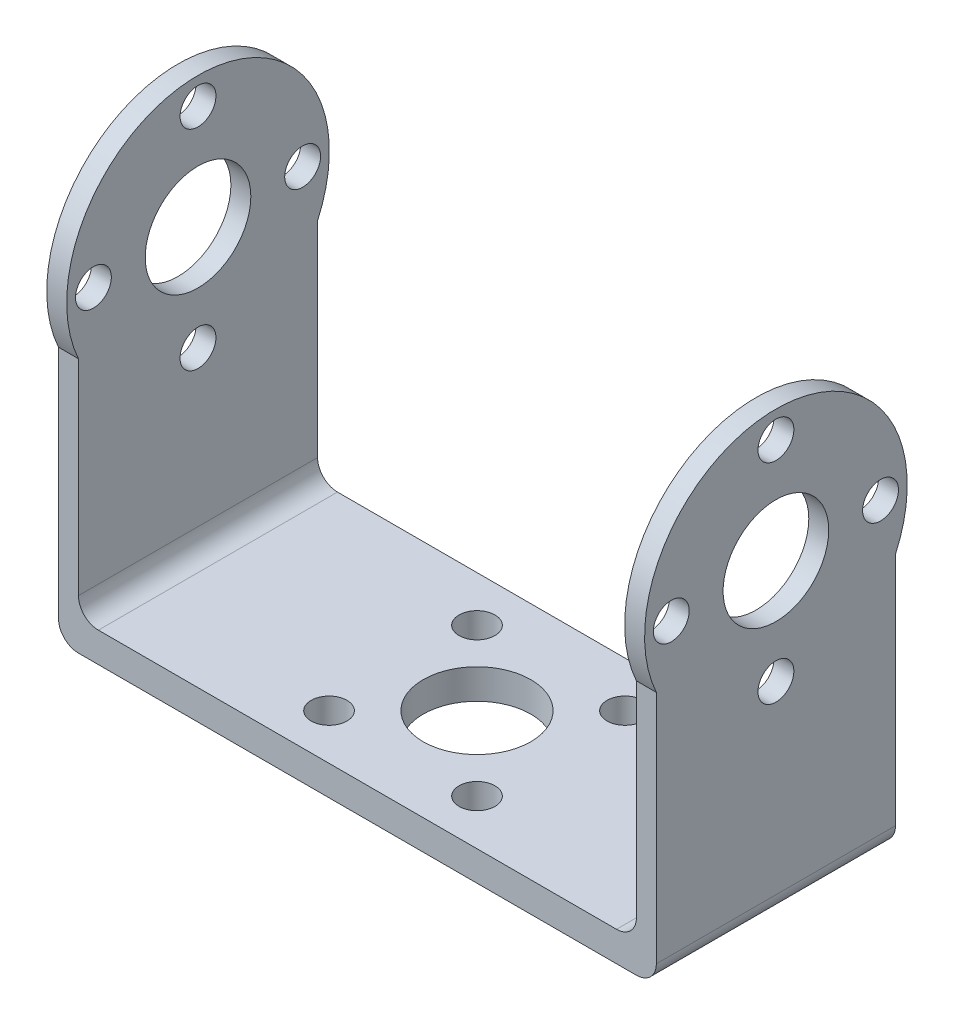
ISO-10303-21;
HEADER;
FILE_DESCRIPTION(('STEP AP214'),'2;1');
FILE_NAME('part.step','',(''),(''),'','','');
FILE_SCHEMA(('AUTOMOTIVE_DESIGN { 1 0 10303 214 1 1 1 1 }'));
ENDSEC;
DATA;
#1=APPLICATION_CONTEXT('core data for automotive mechanical design processes');
#2=APPLICATION_PROTOCOL_DEFINITION('international standard','automotive_design',2000,#1);
#3=PRODUCT_CONTEXT('',#1,'mechanical');
#4=PRODUCT('Part','Part','',(#3));
#5=PRODUCT_RELATED_PRODUCT_CATEGORY('part','',(#4));
#6=PRODUCT_DEFINITION_FORMATION('','',#4);
#7=PRODUCT_DEFINITION_CONTEXT('part definition',#1,'design');
#8=PRODUCT_DEFINITION('design','',#6,#7);
#9=PRODUCT_DEFINITION_SHAPE('','',#8);
#10=(LENGTH_UNIT() NAMED_UNIT(*) SI_UNIT(.MILLI.,.METRE.));
#11=(NAMED_UNIT(*) PLANE_ANGLE_UNIT() SI_UNIT($,.RADIAN.));
#12=(NAMED_UNIT(*) SI_UNIT($,.STERADIAN.) SOLID_ANGLE_UNIT());
#13=UNCERTAINTY_MEASURE_WITH_UNIT(LENGTH_MEASURE(1.E-05),#10,'distance_accuracy_value','');
#14=(GEOMETRIC_REPRESENTATION_CONTEXT(3) GLOBAL_UNCERTAINTY_ASSIGNED_CONTEXT((#13)) GLOBAL_UNIT_ASSIGNED_CONTEXT((#10,
#11,#12)) REPRESENTATION_CONTEXT('',''));
#15=CARTESIAN_POINT('',(0.,0.,0.));
#16=DIRECTION('',(0.,0.,1.));
#17=DIRECTION('',(1.,0.,0.));
#18=AXIS2_PLACEMENT_3D('',#15,#16,#17);
#19=CARTESIAN_POINT('',(-30.,2.,-12.));
#20=DIRECTION('',(1.,0.,0.));
#21=DIRECTION('',(0.,0.,-1.));
#22=AXIS2_PLACEMENT_3D('',#19,#20,#21);
#23=PLANE('',#22);
#24=CARTESIAN_POINT('',(-30.,19.54,-5.4193768532179E-13));
#25=DIRECTION('',(1.,0.,0.));
#26=DIRECTION('',(0.,0.,-1.));
#27=AXIS2_PLACEMENT_3D('',#24,#25,#26);
#28=CIRCLE('',#27,1.8);
#29=CARTESIAN_POINT('',(-30.,19.54,-1.80000000000054));
#30=VERTEX_POINT('',#29);
#31=EDGE_CURVE('E304',#30,#30,#28,.T.);
#32=ORIENTED_EDGE('',*,*,#31,.T.);
#33=EDGE_LOOP('',(#32));
#34=FACE_BOUND('',#33,.T.);
#35=CARTESIAN_POINT('',(-30.,40.54,0.));
#36=DIRECTION('',(1.,0.,0.));
#37=DIRECTION('',(0.,0.,-1.));
#38=AXIS2_PLACEMENT_3D('',#35,#36,#37);
#39=CIRCLE('',#38,1.8);
#40=CARTESIAN_POINT('',(-30.,40.54,-1.8));
#41=VERTEX_POINT('',#40);
#42=EDGE_CURVE('E316',#41,#41,#39,.T.);
#43=ORIENTED_EDGE('',*,*,#42,.T.);
#44=EDGE_LOOP('',(#43));
#45=FACE_BOUND('',#44,.T.);
#46=DIRECTION('',(0.,-1.,0.));
#47=VECTOR('',#46,1.);
#48=CARTESIAN_POINT('',(-30.,2.,-12.));
#49=LINE('',#48,#47);
#50=CARTESIAN_POINT('',(-30.,24.5890918187884,-12.));
#51=VERTEX_POINT('',#50);
#52=CARTESIAN_POINT('',(-30.,1.,-12.));
#53=VERTEX_POINT('',#52);
#54=EDGE_CURVE('E279',#51,#53,#49,.T.);
#55=ORIENTED_EDGE('',*,*,#54,.T.);
#56=DIRECTION('',(0.,0.,-1.));
#57=VECTOR('',#56,1.);
#58=CARTESIAN_POINT('',(-30.,1.,12.));
#59=LINE('',#58,#57);
#60=CARTESIAN_POINT('',(-30.,1.,12.));
#61=VERTEX_POINT('',#60);
#62=EDGE_CURVE('E55',#53,#61,#59,.F.);
#63=ORIENTED_EDGE('',*,*,#62,.T.);
#64=DIRECTION('',(0.,-1.,0.));
#65=VECTOR('',#64,1.);
#66=CARTESIAN_POINT('',(-30.,2.,12.));
#67=LINE('',#66,#65);
#68=CARTESIAN_POINT('',(-30.,24.5890918187883,12.));
#69=VERTEX_POINT('',#68);
#70=EDGE_CURVE('E280',#69,#61,#67,.T.);
#71=ORIENTED_EDGE('',*,*,#70,.F.);
#72=CARTESIAN_POINT('',(-30.,30.04,0.));
#73=DIRECTION('',(1.,0.,0.));
#74=DIRECTION('',(0.,0.,-1.));
#75=AXIS2_PLACEMENT_3D('',#72,#73,#74);
#76=CIRCLE('',#75,13.18);
#77=EDGE_CURVE('E140',#51,#69,#76,.T.);
#78=ORIENTED_EDGE('',*,*,#77,.F.);
#79=EDGE_LOOP('',(#55,#63,#71,#78));
#80=FACE_BOUND('',#79,.T.);
#81=CARTESIAN_POINT('',(-30.,30.04,0.));
#82=DIRECTION('',(1.,0.,0.));
#83=DIRECTION('',(0.,0.,-1.));
#84=AXIS2_PLACEMENT_3D('',#81,#82,#83);
#85=CIRCLE('',#84,5.3);
#86=CARTESIAN_POINT('',(-30.,30.04,-5.29999999999999));
#87=VERTEX_POINT('',#86);
#88=EDGE_CURVE('E319',#87,#87,#85,.T.);
#89=ORIENTED_EDGE('',*,*,#88,.T.);
#90=EDGE_LOOP('',(#89));
#91=FACE_BOUND('',#90,.T.);
#92=CARTESIAN_POINT('',(-30.,30.0400000000003,-10.5000000000003));
#93=DIRECTION('',(1.,0.,0.));
#94=DIRECTION('',(0.,0.,-1.));
#95=AXIS2_PLACEMENT_3D('',#92,#93,#94);
#96=CIRCLE('',#95,1.8);
#97=CARTESIAN_POINT('',(-30.,30.0400000000003,-12.3000000000003));
#98=VERTEX_POINT('',#97);
#99=EDGE_CURVE('E310',#98,#98,#96,.T.);
#100=ORIENTED_EDGE('',*,*,#99,.T.);
#101=EDGE_LOOP('',(#100));
#102=FACE_BOUND('',#101,.T.);
#103=CARTESIAN_POINT('',(-30.,30.0399999999997,10.4999999999997));
#104=DIRECTION('',(1.,0.,0.));
#105=DIRECTION('',(0.,0.,-1.));
#106=AXIS2_PLACEMENT_3D('',#103,#104,#105);
#107=CIRCLE('',#106,1.8);
#108=CARTESIAN_POINT('',(-30.,30.0399999999997,8.69999999999973));
#109=VERTEX_POINT('',#108);
#110=EDGE_CURVE('E298',#109,#109,#107,.T.);
#111=ORIENTED_EDGE('',*,*,#110,.T.);
#112=EDGE_LOOP('',(#111));
#113=FACE_BOUND('',#112,.T.);
#114=ADVANCED_FACE('F32',(#34,#45,#80,#91,#102,#113),#23,.F.);
#115=CARTESIAN_POINT('',(-28.,30.04,0.));
#116=DIRECTION('',(-1.,0.,0.));
#117=DIRECTION('',(0.,0.,-1.));
#118=AXIS2_PLACEMENT_3D('',#115,#116,#117);
#119=PLANE('',#118);
#120=CARTESIAN_POINT('',(-28.,19.54,-5.4193768532179E-13));
#121=DIRECTION('',(-1.,0.,0.));
#122=DIRECTION('',(0.,0.,1.));
#123=AXIS2_PLACEMENT_3D('',#120,#121,#122);
#124=CIRCLE('',#123,1.8);
#125=CARTESIAN_POINT('',(-28.,19.54,1.79999999999946));
#126=VERTEX_POINT('',#125);
#127=EDGE_CURVE('E301',#126,#126,#124,.T.);
#128=ORIENTED_EDGE('',*,*,#127,.T.);
#129=EDGE_LOOP('',(#128));
#130=FACE_BOUND('',#129,.T.);
#131=CARTESIAN_POINT('',(-28.,40.54,0.));
#132=DIRECTION('',(-1.,0.,0.));
#133=DIRECTION('',(0.,0.,1.));
#134=AXIS2_PLACEMENT_3D('',#131,#132,#133);
#135=CIRCLE('',#134,1.8);
#136=CARTESIAN_POINT('',(-28.,40.54,1.8));
#137=VERTEX_POINT('',#136);
#138=EDGE_CURVE('E313',#137,#137,#135,.T.);
#139=ORIENTED_EDGE('',*,*,#138,.T.);
#140=EDGE_LOOP('',(#139));
#141=FACE_BOUND('',#140,.T.);
#142=DIRECTION('',(0.,-1.,0.));
#143=VECTOR('',#142,1.);
#144=CARTESIAN_POINT('',(-28.,2.,12.));
#145=LINE('',#144,#143);
#146=CARTESIAN_POINT('',(-28.,24.5890918187883,12.));
#147=VERTEX_POINT('',#146);
#148=CARTESIAN_POINT('',(-28.,4.,12.));
#149=VERTEX_POINT('',#148);
#150=EDGE_CURVE('E127',#147,#149,#145,.T.);
#151=ORIENTED_EDGE('',*,*,#150,.T.);
#152=DIRECTION('',(0.,0.,-1.));
#153=VECTOR('',#152,1.);
#154=CARTESIAN_POINT('',(-28.,4.,0.));
#155=LINE('',#154,#153);
#156=CARTESIAN_POINT('',(-28.,4.,-12.));
#157=VERTEX_POINT('',#156);
#158=EDGE_CURVE('E208',#149,#157,#155,.T.);
#159=ORIENTED_EDGE('',*,*,#158,.T.);
#160=DIRECTION('',(0.,1.,0.));
#161=VECTOR('',#160,1.);
#162=CARTESIAN_POINT('',(-28.,2.,-12.));
#163=LINE('',#162,#161);
#164=CARTESIAN_POINT('',(-28.,24.5890918187884,-12.));
#165=VERTEX_POINT('',#164);
#166=EDGE_CURVE('E130',#157,#165,#163,.T.);
#167=ORIENTED_EDGE('',*,*,#166,.T.);
#168=CARTESIAN_POINT('',(-28.,30.04,0.));
#169=DIRECTION('',(1.,0.,0.));
#170=DIRECTION('',(0.,0.,-1.));
#171=AXIS2_PLACEMENT_3D('',#168,#169,#170);
#172=CIRCLE('',#171,13.18);
#173=EDGE_CURVE('E121',#165,#147,#172,.T.);
#174=ORIENTED_EDGE('',*,*,#173,.T.);
#175=EDGE_LOOP('',(#151,#159,#167,#174));
#176=FACE_BOUND('',#175,.T.);
#177=CARTESIAN_POINT('',(-28.,30.04,0.));
#178=DIRECTION('',(1.,0.,0.));
#179=DIRECTION('',(0.,0.,-1.));
#180=AXIS2_PLACEMENT_3D('',#177,#178,#179);
#181=CIRCLE('',#180,5.3);
#182=CARTESIAN_POINT('',(-28.,30.04,-5.29999999999999));
#183=VERTEX_POINT('',#182);
#184=EDGE_CURVE('E152',#183,#183,#181,.T.);
#185=ORIENTED_EDGE('',*,*,#184,.F.);
#186=EDGE_LOOP('',(#185));
#187=FACE_BOUND('',#186,.T.);
#188=CARTESIAN_POINT('',(-28.,30.0400000000003,-10.5000000000003));
#189=DIRECTION('',(-1.,0.,0.));
#190=DIRECTION('',(0.,0.,1.));
#191=AXIS2_PLACEMENT_3D('',#188,#189,#190);
#192=CIRCLE('',#191,1.8);
#193=CARTESIAN_POINT('',(-28.,30.0400000000003,-8.70000000000027));
#194=VERTEX_POINT('',#193);
#195=EDGE_CURVE('E307',#194,#194,#192,.T.);
#196=ORIENTED_EDGE('',*,*,#195,.T.);
#197=EDGE_LOOP('',(#196));
#198=FACE_BOUND('',#197,.T.);
#199=CARTESIAN_POINT('',(-28.,30.0399999999997,10.4999999999997));
#200=DIRECTION('',(-1.,0.,0.));
#201=DIRECTION('',(0.,0.,1.));
#202=AXIS2_PLACEMENT_3D('',#199,#200,#201);
#203=CIRCLE('',#202,1.8);
#204=CARTESIAN_POINT('',(-28.,30.0399999999997,12.2999999999997));
#205=VERTEX_POINT('',#204);
#206=EDGE_CURVE('E291',#205,#205,#203,.T.);
#207=ORIENTED_EDGE('',*,*,#206,.T.);
#208=EDGE_LOOP('',(#207));
#209=FACE_BOUND('',#208,.T.);
#210=ADVANCED_FACE('F123',(#130,#141,#176,#187,#198,#209),#119,.F.);
#211=CARTESIAN_POINT('',(0.,2.,0.));
#212=DIRECTION('',(0.,1.,0.));
#213=DIRECTION('',(0.,0.,1.));
#214=AXIS2_PLACEMENT_3D('',#211,#212,#213);
#215=PLANE('',#214);
#216=CARTESIAN_POINT('',(7.42562120245866,2.,7.42362120245884));
#217=DIRECTION('',(0.,1.,0.));
#218=DIRECTION('',(0.,0.,1.));
#219=AXIS2_PLACEMENT_3D('',#216,#217,#218);
#220=CIRCLE('',#219,1.8);
#221=CARTESIAN_POINT('',(7.42562120245866,2.,9.22362120245884));
#222=VERTEX_POINT('',#221);
#223=EDGE_CURVE('E692',#222,#222,#220,.F.);
#224=ORIENTED_EDGE('',*,*,#223,.T.);
#225=EDGE_LOOP('',(#224));
#226=FACE_BOUND('',#225,.T.);
#227=CARTESIAN_POINT('',(-7.42262120245884,2.,7.42462120245866));
#228=DIRECTION('',(0.,1.,0.));
#229=DIRECTION('',(0.,0.,1.));
#230=AXIS2_PLACEMENT_3D('',#227,#228,#229);
#231=CIRCLE('',#230,1.8);
#232=CARTESIAN_POINT('',(-7.42262120245884,2.,9.22462120245866));
#233=VERTEX_POINT('',#232);
#234=EDGE_CURVE('E686',#233,#233,#231,.F.);
#235=ORIENTED_EDGE('',*,*,#234,.T.);
#236=EDGE_LOOP('',(#235));
#237=FACE_BOUND('',#236,.T.);
#238=CARTESIAN_POINT('',(-7.42362120245866,2.,-7.42362120245884));
#239=DIRECTION('',(0.,1.,0.));
#240=DIRECTION('',(0.,0.,1.));
#241=AXIS2_PLACEMENT_3D('',#238,#239,#240);
#242=CIRCLE('',#241,1.8);
#243=CARTESIAN_POINT('',(-7.42362120245866,2.,-5.62362120245884));
#244=VERTEX_POINT('',#243);
#245=EDGE_CURVE('E680',#244,#244,#242,.F.);
#246=ORIENTED_EDGE('',*,*,#245,.T.);
#247=EDGE_LOOP('',(#246));
#248=FACE_BOUND('',#247,.T.);
#249=CARTESIAN_POINT('',(7.42462120245884,2.,-7.42462120245866));
#250=DIRECTION('',(0.,1.,0.));
#251=DIRECTION('',(0.,0.,1.));
#252=AXIS2_PLACEMENT_3D('',#249,#250,#251);
#253=CIRCLE('',#252,1.8);
#254=CARTESIAN_POINT('',(7.42462120245884,2.,-5.62462120245866));
#255=VERTEX_POINT('',#254);
#256=EDGE_CURVE('E672',#255,#255,#253,.F.);
#257=ORIENTED_EDGE('',*,*,#256,.T.);
#258=EDGE_LOOP('',(#257));
#259=FACE_BOUND('',#258,.T.);
#260=CARTESIAN_POINT('',(0.,2.,0.));
#261=DIRECTION('',(0.,1.,0.));
#262=DIRECTION('',(0.,0.,1.));
#263=AXIS2_PLACEMENT_3D('',#260,#261,#262);
#264=CIRCLE('',#263,5.4);
#265=CARTESIAN_POINT('',(0.,2.,5.4));
#266=VERTEX_POINT('',#265);
#267=EDGE_CURVE('E294',#266,#266,#264,.F.);
#268=ORIENTED_EDGE('',*,*,#267,.T.);
#269=EDGE_LOOP('',(#268));
#270=FACE_BOUND('',#269,.T.);
#271=DIRECTION('',(-1.,0.,0.));
#272=VECTOR('',#271,1.);
#273=CARTESIAN_POINT('',(-30.,2.,-12.));
#274=LINE('',#273,#272);
#275=CARTESIAN_POINT('',(26.,2.,-12.));
#276=VERTEX_POINT('',#275);
#277=CARTESIAN_POINT('',(-26.,2.,-12.));
#278=VERTEX_POINT('',#277);
#279=EDGE_CURVE('E195',#276,#278,#274,.T.);
#280=ORIENTED_EDGE('',*,*,#279,.T.);
#281=DIRECTION('',(0.,0.,-1.));
#282=VECTOR('',#281,1.);
#283=CARTESIAN_POINT('',(-26.,2.,0.));
#284=LINE('',#283,#282);
#285=CARTESIAN_POINT('',(-26.,2.,12.));
#286=VERTEX_POINT('',#285);
#287=EDGE_CURVE('E216',#278,#286,#284,.F.);
#288=ORIENTED_EDGE('',*,*,#287,.T.);
#289=DIRECTION('',(1.,0.,0.));
#290=VECTOR('',#289,1.);
#291=CARTESIAN_POINT('',(-30.,2.,12.));
#292=LINE('',#291,#290);
#293=CARTESIAN_POINT('',(26.,2.,12.));
#294=VERTEX_POINT('',#293);
#295=EDGE_CURVE('E207',#286,#294,#292,.T.);
#296=ORIENTED_EDGE('',*,*,#295,.T.);
#297=DIRECTION('',(0.,0.,-1.));
#298=VECTOR('',#297,1.);
#299=CARTESIAN_POINT('',(26.,2.,0.));
#300=LINE('',#299,#298);
#301=EDGE_CURVE('E213',#294,#276,#300,.T.);
#302=ORIENTED_EDGE('',*,*,#301,.T.);
#303=EDGE_LOOP('',(#280,#288,#296,#302));
#304=FACE_BOUND('',#303,.T.);
#305=ADVANCED_FACE('F239',(#226,#237,#248,#259,#270,#304),#215,.T.);
#306=CARTESIAN_POINT('',(30.,2.,-12.));
#307=DIRECTION('',(-1.,0.,0.));
#308=DIRECTION('',(0.,0.,1.));
#309=AXIS2_PLACEMENT_3D('',#306,#307,#308);
#310=PLANE('',#309);
#311=CARTESIAN_POINT('',(30.,30.0399999999997,10.4999999999997));
#312=DIRECTION('',(1.,0.,0.));
#313=DIRECTION('',(0.,0.,-1.));
#314=AXIS2_PLACEMENT_3D('',#311,#312,#313);
#315=CIRCLE('',#314,1.8);
#316=CARTESIAN_POINT('',(30.,30.0399999999997,8.69999999999973));
#317=VERTEX_POINT('',#316);
#318=EDGE_CURVE('E153',#317,#317,#315,.T.);
#319=ORIENTED_EDGE('',*,*,#318,.F.);
#320=EDGE_LOOP('',(#319));
#321=FACE_BOUND('',#320,.T.);
#322=CARTESIAN_POINT('',(30.,19.54,-5.4193768532179E-13));
#323=DIRECTION('',(1.,0.,0.));
#324=DIRECTION('',(0.,0.,-1.));
#325=AXIS2_PLACEMENT_3D('',#322,#323,#324);
#326=CIRCLE('',#325,1.8);
#327=CARTESIAN_POINT('',(30.,19.54,-1.80000000000054));
#328=VERTEX_POINT('',#327);
#329=EDGE_CURVE('E160',#328,#328,#326,.T.);
#330=ORIENTED_EDGE('',*,*,#329,.F.);
#331=EDGE_LOOP('',(#330));
#332=FACE_BOUND('',#331,.T.);
#333=CARTESIAN_POINT('',(30.,30.0400000000003,-10.5000000000003));
#334=DIRECTION('',(1.,0.,0.));
#335=DIRECTION('',(0.,0.,-1.));
#336=AXIS2_PLACEMENT_3D('',#333,#334,#335);
#337=CIRCLE('',#336,1.8);
#338=CARTESIAN_POINT('',(30.,30.0400000000003,-12.3000000000003));
#339=VERTEX_POINT('',#338);
#340=EDGE_CURVE('E166',#339,#339,#337,.T.);
#341=ORIENTED_EDGE('',*,*,#340,.F.);
#342=EDGE_LOOP('',(#341));
#343=FACE_BOUND('',#342,.T.);
#344=CARTESIAN_POINT('',(30.,40.54,0.));
#345=DIRECTION('',(1.,0.,0.));
#346=DIRECTION('',(0.,0.,-1.));
#347=AXIS2_PLACEMENT_3D('',#344,#345,#346);
#348=CIRCLE('',#347,1.8);
#349=CARTESIAN_POINT('',(30.,40.54,-1.8));
#350=VERTEX_POINT('',#349);
#351=EDGE_CURVE('E172',#350,#350,#348,.T.);
#352=ORIENTED_EDGE('',*,*,#351,.F.);
#353=EDGE_LOOP('',(#352));
#354=FACE_BOUND('',#353,.T.);
#355=DIRECTION('',(0.,-1.,0.));
#356=VECTOR('',#355,1.);
#357=CARTESIAN_POINT('',(30.,2.,12.));
#358=LINE('',#357,#356);
#359=CARTESIAN_POINT('',(30.,24.5890918187883,12.));
#360=VERTEX_POINT('',#359);
#361=CARTESIAN_POINT('',(30.,1.,12.));
#362=VERTEX_POINT('',#361);
#363=EDGE_CURVE('E212',#360,#362,#358,.T.);
#364=ORIENTED_EDGE('',*,*,#363,.T.);
#365=DIRECTION('',(0.,0.,1.));
#366=VECTOR('',#365,1.);
#367=CARTESIAN_POINT('',(30.,1.,-12.));
#368=LINE('',#367,#366);
#369=CARTESIAN_POINT('',(30.,1.,-12.));
#370=VERTEX_POINT('',#369);
#371=EDGE_CURVE('E247',#362,#370,#368,.F.);
#372=ORIENTED_EDGE('',*,*,#371,.T.);
#373=DIRECTION('',(0.,-1.,0.));
#374=VECTOR('',#373,1.);
#375=CARTESIAN_POINT('',(30.,2.,-12.));
#376=LINE('',#375,#374);
#377=CARTESIAN_POINT('',(30.,24.5890918187884,-12.));
#378=VERTEX_POINT('',#377);
#379=EDGE_CURVE('E225',#378,#370,#376,.T.);
#380=ORIENTED_EDGE('',*,*,#379,.F.);
#381=CARTESIAN_POINT('',(30.,30.04,0.));
#382=DIRECTION('',(1.,0.,0.));
#383=DIRECTION('',(0.,0.,-1.));
#384=AXIS2_PLACEMENT_3D('',#381,#382,#383);
#385=CIRCLE('',#384,13.18);
#386=EDGE_CURVE('E182',#378,#360,#385,.T.);
#387=ORIENTED_EDGE('',*,*,#386,.T.);
#388=EDGE_LOOP('',(#364,#372,#380,#387));
#389=FACE_BOUND('',#388,.T.);
#390=CARTESIAN_POINT('',(30.,30.04,0.));
#391=DIRECTION('',(1.,0.,0.));
#392=DIRECTION('',(0.,0.,-1.));
#393=AXIS2_PLACEMENT_3D('',#390,#391,#392);
#394=CIRCLE('',#393,5.3);
#395=CARTESIAN_POINT('',(30.,30.04,-5.29999999999999));
#396=VERTEX_POINT('',#395);
#397=EDGE_CURVE('E178',#396,#396,#394,.T.);
#398=ORIENTED_EDGE('',*,*,#397,.F.);
#399=EDGE_LOOP('',(#398));
#400=FACE_BOUND('',#399,.T.);
#401=ADVANCED_FACE('F275',(#321,#332,#343,#354,#389,#400),#310,.F.);
#402=CARTESIAN_POINT('',(-30.,2.,-12.));
#403=DIRECTION('',(0.,0.,1.));
#404=DIRECTION('',(1.,0.,0.));
#405=AXIS2_PLACEMENT_3D('',#402,#403,#404);
#406=PLANE('',#405);
#407=DIRECTION('',(1.,0.,0.));
#408=VECTOR('',#407,1.);
#409=CARTESIAN_POINT('',(-30.,-1.,-12.));
#410=LINE('',#409,#408);
#411=CARTESIAN_POINT('',(-28.,-1.,-12.));
#412=VERTEX_POINT('',#411);
#413=CARTESIAN_POINT('',(28.,-1.,-12.));
#414=VERTEX_POINT('',#413);
#415=EDGE_CURVE('E287',#412,#414,#410,.T.);
#416=ORIENTED_EDGE('',*,*,#415,.F.);
#417=CARTESIAN_POINT('',(-28.,1.,-12.));
#418=DIRECTION('',(0.,0.,1.));
#419=DIRECTION('',(1.,0.,0.));
#420=AXIS2_PLACEMENT_3D('',#417,#418,#419);
#421=CIRCLE('',#420,2.);
#422=EDGE_CURVE('E256',#412,#53,#421,.F.);
#423=ORIENTED_EDGE('',*,*,#422,.T.);
#424=ORIENTED_EDGE('',*,*,#54,.F.);
#425=DIRECTION('',(-1.,0.,0.));
#426=VECTOR('',#425,1.);
#427=CARTESIAN_POINT('',(-28.,24.5890918187884,-12.));
#428=LINE('',#427,#426);
#429=EDGE_CURVE('E141',#165,#51,#428,.T.);
#430=ORIENTED_EDGE('',*,*,#429,.F.);
#431=ORIENTED_EDGE('',*,*,#166,.F.);
#432=CARTESIAN_POINT('',(-26.,4.,-12.));
#433=DIRECTION('',(0.,0.,1.));
#434=DIRECTION('',(1.,0.,0.));
#435=AXIS2_PLACEMENT_3D('',#432,#433,#434);
#436=CIRCLE('',#435,2.);
#437=EDGE_CURVE('E245',#157,#278,#436,.T.);
#438=ORIENTED_EDGE('',*,*,#437,.T.);
#439=ORIENTED_EDGE('',*,*,#279,.F.);
#440=CARTESIAN_POINT('',(26.,4.,-12.));
#441=DIRECTION('',(0.,0.,1.));
#442=DIRECTION('',(1.,0.,0.));
#443=AXIS2_PLACEMENT_3D('',#440,#441,#442);
#444=CIRCLE('',#443,2.);
#445=CARTESIAN_POINT('',(28.,4.,-12.));
#446=VERTEX_POINT('',#445);
#447=EDGE_CURVE('E40',#276,#446,#444,.T.);
#448=ORIENTED_EDGE('',*,*,#447,.T.);
#449=DIRECTION('',(0.,1.,0.));
#450=VECTOR('',#449,1.);
#451=CARTESIAN_POINT('',(28.,2.,-12.));
#452=LINE('',#451,#450);
#453=CARTESIAN_POINT('',(28.,24.5890918187884,-12.));
#454=VERTEX_POINT('',#453);
#455=EDGE_CURVE('E189',#446,#454,#452,.T.);
#456=ORIENTED_EDGE('',*,*,#455,.T.);
#457=DIRECTION('',(1.,0.,0.));
#458=VECTOR('',#457,1.);
#459=CARTESIAN_POINT('',(28.,24.5890918187884,-12.));
#460=LINE('',#459,#458);
#461=EDGE_CURVE('E196',#454,#378,#460,.T.);
#462=ORIENTED_EDGE('',*,*,#461,.T.);
#463=ORIENTED_EDGE('',*,*,#379,.T.);
#464=CARTESIAN_POINT('',(28.,1.,-12.));
#465=DIRECTION('',(0.,0.,1.));
#466=DIRECTION('',(1.,0.,0.));
#467=AXIS2_PLACEMENT_3D('',#464,#465,#466);
#468=CIRCLE('',#467,2.);
#469=EDGE_CURVE('E258',#370,#414,#468,.F.);
#470=ORIENTED_EDGE('',*,*,#469,.T.);
#471=EDGE_LOOP('',(#416,#423,#424,#430,#431,#438,#439,#448,#456,#462,#463,#470));
#472=FACE_BOUND('',#471,.T.);
#473=ADVANCED_FACE('F243',(#472),#406,.F.);
#474=CARTESIAN_POINT('',(-30.,2.,12.));
#475=DIRECTION('',(0.,0.,-1.));
#476=DIRECTION('',(-1.,0.,0.));
#477=AXIS2_PLACEMENT_3D('',#474,#475,#476);
#478=PLANE('',#477);
#479=ORIENTED_EDGE('',*,*,#70,.T.);
#480=CARTESIAN_POINT('',(-28.,1.,12.));
#481=DIRECTION('',(0.,0.,-1.));
#482=DIRECTION('',(-1.,0.,0.));
#483=AXIS2_PLACEMENT_3D('',#480,#481,#482);
#484=CIRCLE('',#483,2.);
#485=CARTESIAN_POINT('',(-28.,-1.,12.));
#486=VERTEX_POINT('',#485);
#487=EDGE_CURVE('E250',#61,#486,#484,.F.);
#488=ORIENTED_EDGE('',*,*,#487,.T.);
#489=DIRECTION('',(-1.,0.,0.));
#490=VECTOR('',#489,1.);
#491=CARTESIAN_POINT('',(-30.,-1.,12.));
#492=LINE('',#491,#490);
#493=CARTESIAN_POINT('',(28.,-1.,12.));
#494=VERTEX_POINT('',#493);
#495=EDGE_CURVE('E288',#494,#486,#492,.T.);
#496=ORIENTED_EDGE('',*,*,#495,.F.);
#497=CARTESIAN_POINT('',(28.,1.,12.));
#498=DIRECTION('',(0.,0.,-1.));
#499=DIRECTION('',(-1.,0.,0.));
#500=AXIS2_PLACEMENT_3D('',#497,#498,#499);
#501=CIRCLE('',#500,2.);
#502=EDGE_CURVE('E47',#494,#362,#501,.F.);
#503=ORIENTED_EDGE('',*,*,#502,.T.);
#504=ORIENTED_EDGE('',*,*,#363,.F.);
#505=DIRECTION('',(1.,0.,0.));
#506=VECTOR('',#505,1.);
#507=CARTESIAN_POINT('',(28.,24.5890918187883,12.));
#508=LINE('',#507,#506);
#509=CARTESIAN_POINT('',(28.,24.5890918187883,12.));
#510=VERTEX_POINT('',#509);
#511=EDGE_CURVE('E192',#510,#360,#508,.T.);
#512=ORIENTED_EDGE('',*,*,#511,.F.);
#513=DIRECTION('',(0.,-1.,0.));
#514=VECTOR('',#513,1.);
#515=CARTESIAN_POINT('',(28.,2.,12.));
#516=LINE('',#515,#514);
#517=CARTESIAN_POINT('',(28.,4.,12.));
#518=VERTEX_POINT('',#517);
#519=EDGE_CURVE('E188',#510,#518,#516,.T.);
#520=ORIENTED_EDGE('',*,*,#519,.T.);
#521=CARTESIAN_POINT('',(26.,4.,12.));
#522=DIRECTION('',(0.,0.,-1.));
#523=DIRECTION('',(-1.,0.,0.));
#524=AXIS2_PLACEMENT_3D('',#521,#522,#523);
#525=CIRCLE('',#524,2.);
#526=EDGE_CURVE('E11',#518,#294,#525,.T.);
#527=ORIENTED_EDGE('',*,*,#526,.T.);
#528=ORIENTED_EDGE('',*,*,#295,.F.);
#529=CARTESIAN_POINT('',(-26.,4.,12.));
#530=DIRECTION('',(0.,0.,-1.));
#531=DIRECTION('',(-1.,0.,0.));
#532=AXIS2_PLACEMENT_3D('',#529,#530,#531);
#533=CIRCLE('',#532,2.);
#534=EDGE_CURVE('E146',#286,#149,#533,.T.);
#535=ORIENTED_EDGE('',*,*,#534,.T.);
#536=ORIENTED_EDGE('',*,*,#150,.F.);
#537=DIRECTION('',(-1.,0.,0.));
#538=VECTOR('',#537,1.);
#539=CARTESIAN_POINT('',(-28.,24.5890918187883,12.));
#540=LINE('',#539,#538);
#541=EDGE_CURVE('E134',#147,#69,#540,.T.);
#542=ORIENTED_EDGE('',*,*,#541,.T.);
#543=EDGE_LOOP('',(#479,#488,#496,#503,#504,#512,#520,#527,#528,#535,#536,#542));
#544=FACE_BOUND('',#543,.T.);
#545=ADVANCED_FACE('F143',(#544),#478,.F.);
#546=CARTESIAN_POINT('',(28.,30.04,0.));
#547=DIRECTION('',(1.,0.,0.));
#548=DIRECTION('',(0.,0.,-1.));
#549=AXIS2_PLACEMENT_3D('',#546,#547,#548);
#550=CYLINDRICAL_SURFACE('',#549,13.18);
#551=ORIENTED_EDGE('',*,*,#386,.F.);
#552=ORIENTED_EDGE('',*,*,#461,.F.);
#553=CARTESIAN_POINT('',(28.,30.04,0.));
#554=DIRECTION('',(1.,0.,0.));
#555=DIRECTION('',(0.,0.,-1.));
#556=AXIS2_PLACEMENT_3D('',#553,#554,#555);
#557=CIRCLE('',#556,13.18);
#558=EDGE_CURVE('E185',#454,#510,#557,.T.);
#559=ORIENTED_EDGE('',*,*,#558,.T.);
#560=ORIENTED_EDGE('',*,*,#511,.T.);
#561=EDGE_LOOP('',(#551,#552,#559,#560));
#562=FACE_BOUND('',#561,.T.);
#563=ADVANCED_FACE('F273',(#562),#550,.T.);
#564=CARTESIAN_POINT('',(28.,30.04,0.));
#565=DIRECTION('',(1.,0.,0.));
#566=DIRECTION('',(0.,0.,-1.));
#567=AXIS2_PLACEMENT_3D('',#564,#565,#566);
#568=PLANE('',#567);
#569=CARTESIAN_POINT('',(28.,30.0399999999997,10.4999999999997));
#570=DIRECTION('',(1.,0.,0.));
#571=DIRECTION('',(0.,0.,-1.));
#572=AXIS2_PLACEMENT_3D('',#569,#570,#571);
#573=CIRCLE('',#572,1.8);
#574=CARTESIAN_POINT('',(28.,30.0399999999997,8.69999999999973));
#575=VERTEX_POINT('',#574);
#576=EDGE_CURVE('E157',#575,#575,#573,.F.);
#577=ORIENTED_EDGE('',*,*,#576,.F.);
#578=EDGE_LOOP('',(#577));
#579=FACE_BOUND('',#578,.T.);
#580=CARTESIAN_POINT('',(28.,19.54,-5.4193768532179E-13));
#581=DIRECTION('',(1.,0.,0.));
#582=DIRECTION('',(0.,0.,-1.));
#583=AXIS2_PLACEMENT_3D('',#580,#581,#582);
#584=CIRCLE('',#583,1.8);
#585=CARTESIAN_POINT('',(28.,19.54,-1.80000000000054));
#586=VERTEX_POINT('',#585);
#587=EDGE_CURVE('E163',#586,#586,#584,.F.);
#588=ORIENTED_EDGE('',*,*,#587,.F.);
#589=EDGE_LOOP('',(#588));
#590=FACE_BOUND('',#589,.T.);
#591=CARTESIAN_POINT('',(28.,30.0400000000003,-10.5000000000003));
#592=DIRECTION('',(1.,0.,0.));
#593=DIRECTION('',(0.,0.,-1.));
#594=AXIS2_PLACEMENT_3D('',#591,#592,#593);
#595=CIRCLE('',#594,1.8);
#596=CARTESIAN_POINT('',(28.,30.0400000000003,-12.3000000000003));
#597=VERTEX_POINT('',#596);
#598=EDGE_CURVE('E169',#597,#597,#595,.F.);
#599=ORIENTED_EDGE('',*,*,#598,.F.);
#600=EDGE_LOOP('',(#599));
#601=FACE_BOUND('',#600,.T.);
#602=CARTESIAN_POINT('',(28.,40.54,0.));
#603=DIRECTION('',(1.,0.,0.));
#604=DIRECTION('',(0.,0.,-1.));
#605=AXIS2_PLACEMENT_3D('',#602,#603,#604);
#606=CIRCLE('',#605,1.8);
#607=CARTESIAN_POINT('',(28.,40.54,-1.8));
#608=VERTEX_POINT('',#607);
#609=EDGE_CURVE('E175',#608,#608,#606,.F.);
#610=ORIENTED_EDGE('',*,*,#609,.F.);
#611=EDGE_LOOP('',(#610));
#612=FACE_BOUND('',#611,.T.);
#613=CARTESIAN_POINT('',(28.,30.04,0.));
#614=DIRECTION('',(1.,0.,0.));
#615=DIRECTION('',(0.,0.,-1.));
#616=AXIS2_PLACEMENT_3D('',#613,#614,#615);
#617=CIRCLE('',#616,5.3);
#618=CARTESIAN_POINT('',(28.,30.04,-5.29999999999999));
#619=VERTEX_POINT('',#618);
#620=EDGE_CURVE('E179',#619,#619,#617,.T.);
#621=ORIENTED_EDGE('',*,*,#620,.T.);
#622=EDGE_LOOP('',(#621));
#623=FACE_BOUND('',#622,.T.);
#624=ORIENTED_EDGE('',*,*,#455,.F.);
#625=DIRECTION('',(0.,0.,-1.));
#626=VECTOR('',#625,1.);
#627=CARTESIAN_POINT('',(28.,4.,0.));
#628=LINE('',#627,#626);
#629=EDGE_CURVE('E218',#446,#518,#628,.F.);
#630=ORIENTED_EDGE('',*,*,#629,.T.);
#631=ORIENTED_EDGE('',*,*,#519,.F.);
#632=ORIENTED_EDGE('',*,*,#558,.F.);
#633=EDGE_LOOP('',(#624,#630,#631,#632));
#634=FACE_BOUND('',#633,.T.);
#635=ADVANCED_FACE('F268',(#579,#590,#601,#612,#623,#634),#568,.F.);
#636=CARTESIAN_POINT('',(28.,30.04,0.));
#637=DIRECTION('',(1.,0.,0.));
#638=DIRECTION('',(0.,0.,-1.));
#639=AXIS2_PLACEMENT_3D('',#636,#637,#638);
#640=CYLINDRICAL_SURFACE('',#639,5.3);
#641=ORIENTED_EDGE('',*,*,#620,.F.);
#642=EDGE_LOOP('',(#641));
#643=FACE_BOUND('',#642,.T.);
#644=ORIENTED_EDGE('',*,*,#397,.T.);
#645=EDGE_LOOP('',(#644));
#646=FACE_BOUND('',#645,.T.);
#647=ADVANCED_FACE('F413',(#643,#646),#640,.F.);
#648=CARTESIAN_POINT('',(-30.001025,40.54,0.));
#649=DIRECTION('',(1.,0.,0.));
#650=DIRECTION('',(0.,0.,-1.));
#651=AXIS2_PLACEMENT_3D('',#648,#649,#650);
#652=CYLINDRICAL_SURFACE('',#651,1.8);
#653=ORIENTED_EDGE('',*,*,#351,.T.);
#654=EDGE_LOOP('',(#653));
#655=FACE_BOUND('',#654,.T.);
#656=ORIENTED_EDGE('',*,*,#609,.T.);
#657=EDGE_LOOP('',(#656));
#658=FACE_BOUND('',#657,.T.);
#659=ADVANCED_FACE('F575',(#655,#658),#652,.F.);
#660=CARTESIAN_POINT('',(-30.001025,30.0400000000003,-10.5000000000003));
#661=DIRECTION('',(1.,0.,0.));
#662=DIRECTION('',(0.,0.,-1.));
#663=AXIS2_PLACEMENT_3D('',#660,#661,#662);
#664=CYLINDRICAL_SURFACE('',#663,1.8);
#665=ORIENTED_EDGE('',*,*,#340,.T.);
#666=EDGE_LOOP('',(#665));
#667=FACE_BOUND('',#666,.T.);
#668=ORIENTED_EDGE('',*,*,#598,.T.);
#669=EDGE_LOOP('',(#668));
#670=FACE_BOUND('',#669,.T.);
#671=ADVANCED_FACE('F565',(#667,#670),#664,.F.);
#672=CARTESIAN_POINT('',(-30.001025,19.54,-5.4193768532179E-13));
#673=DIRECTION('',(1.,0.,0.));
#674=DIRECTION('',(0.,0.,-1.));
#675=AXIS2_PLACEMENT_3D('',#672,#673,#674);
#676=CYLINDRICAL_SURFACE('',#675,1.8);
#677=ORIENTED_EDGE('',*,*,#329,.T.);
#678=EDGE_LOOP('',(#677));
#679=FACE_BOUND('',#678,.T.);
#680=ORIENTED_EDGE('',*,*,#587,.T.);
#681=EDGE_LOOP('',(#680));
#682=FACE_BOUND('',#681,.T.);
#683=ADVANCED_FACE('F555',(#679,#682),#676,.F.);
#684=CARTESIAN_POINT('',(-30.001025,30.0399999999997,10.4999999999997));
#685=DIRECTION('',(1.,0.,0.));
#686=DIRECTION('',(0.,0.,-1.));
#687=AXIS2_PLACEMENT_3D('',#684,#685,#686);
#688=CYLINDRICAL_SURFACE('',#687,1.8);
#689=ORIENTED_EDGE('',*,*,#318,.T.);
#690=EDGE_LOOP('',(#689));
#691=FACE_BOUND('',#690,.T.);
#692=ORIENTED_EDGE('',*,*,#576,.T.);
#693=EDGE_LOOP('',(#692));
#694=FACE_BOUND('',#693,.T.);
#695=ADVANCED_FACE('F340',(#691,#694),#688,.F.);
#696=CARTESIAN_POINT('',(-28.,30.04,0.));
#697=DIRECTION('',(-1.,0.,0.));
#698=DIRECTION('',(0.,0.,1.));
#699=AXIS2_PLACEMENT_3D('',#696,#697,#698);
#700=CYLINDRICAL_SURFACE('',#699,13.18);
#701=ORIENTED_EDGE('',*,*,#77,.T.);
#702=ORIENTED_EDGE('',*,*,#541,.F.);
#703=ORIENTED_EDGE('',*,*,#173,.F.);
#704=ORIENTED_EDGE('',*,*,#429,.T.);
#705=EDGE_LOOP('',(#701,#702,#703,#704));
#706=FACE_BOUND('',#705,.T.);
#707=ADVANCED_FACE('F138',(#706),#700,.T.);
#708=CARTESIAN_POINT('',(-28.,30.04,0.));
#709=DIRECTION('',(-1.,0.,0.));
#710=DIRECTION('',(0.,0.,1.));
#711=AXIS2_PLACEMENT_3D('',#708,#709,#710);
#712=CYLINDRICAL_SURFACE('',#711,5.3);
#713=ORIENTED_EDGE('',*,*,#184,.T.);
#714=EDGE_LOOP('',(#713));
#715=FACE_BOUND('',#714,.T.);
#716=ORIENTED_EDGE('',*,*,#88,.F.);
#717=EDGE_LOOP('',(#716));
#718=FACE_BOUND('',#717,.T.);
#719=ADVANCED_FACE('F328',(#715,#718),#712,.F.);
#720=CARTESIAN_POINT('',(30.001,40.54,0.));
#721=DIRECTION('',(-1.,0.,0.));
#722=DIRECTION('',(0.,0.,1.));
#723=AXIS2_PLACEMENT_3D('',#720,#721,#722);
#724=CYLINDRICAL_SURFACE('',#723,1.8);
#725=ORIENTED_EDGE('',*,*,#42,.F.);
#726=EDGE_LOOP('',(#725));
#727=FACE_BOUND('',#726,.T.);
#728=ORIENTED_EDGE('',*,*,#138,.F.);
#729=EDGE_LOOP('',(#728));
#730=FACE_BOUND('',#729,.T.);
#731=ADVANCED_FACE('F330',(#727,#730),#724,.F.);
#732=CARTESIAN_POINT('',(30.001,30.0400000000003,-10.5000000000003));
#733=DIRECTION('',(-1.,0.,0.));
#734=DIRECTION('',(0.,0.,1.));
#735=AXIS2_PLACEMENT_3D('',#732,#733,#734);
#736=CYLINDRICAL_SURFACE('',#735,1.8);
#737=ORIENTED_EDGE('',*,*,#99,.F.);
#738=EDGE_LOOP('',(#737));
#739=FACE_BOUND('',#738,.T.);
#740=ORIENTED_EDGE('',*,*,#195,.F.);
#741=EDGE_LOOP('',(#740));
#742=FACE_BOUND('',#741,.T.);
#743=ADVANCED_FACE('F337',(#739,#742),#736,.F.);
#744=CARTESIAN_POINT('',(30.001,19.54,-5.4193768532179E-13));
#745=DIRECTION('',(-1.,0.,0.));
#746=DIRECTION('',(0.,0.,1.));
#747=AXIS2_PLACEMENT_3D('',#744,#745,#746);
#748=CYLINDRICAL_SURFACE('',#747,1.8);
#749=ORIENTED_EDGE('',*,*,#31,.F.);
#750=EDGE_LOOP('',(#749));
#751=FACE_BOUND('',#750,.T.);
#752=ORIENTED_EDGE('',*,*,#127,.F.);
#753=EDGE_LOOP('',(#752));
#754=FACE_BOUND('',#753,.T.);
#755=ADVANCED_FACE('F513',(#751,#754),#748,.F.);
#756=CARTESIAN_POINT('',(30.001,30.0399999999997,10.4999999999997));
#757=DIRECTION('',(-1.,0.,0.));
#758=DIRECTION('',(0.,0.,1.));
#759=AXIS2_PLACEMENT_3D('',#756,#757,#758);
#760=CYLINDRICAL_SURFACE('',#759,1.8);
#761=ORIENTED_EDGE('',*,*,#110,.F.);
#762=EDGE_LOOP('',(#761));
#763=FACE_BOUND('',#762,.T.);
#764=ORIENTED_EDGE('',*,*,#206,.F.);
#765=EDGE_LOOP('',(#764));
#766=FACE_BOUND('',#765,.T.);
#767=ADVANCED_FACE('F399',(#763,#766),#760,.F.);
#768=CARTESIAN_POINT('',(0.,-1.,0.));
#769=DIRECTION('',(0.,-1.,0.));
#770=DIRECTION('',(0.,0.,-1.));
#771=AXIS2_PLACEMENT_3D('',#768,#769,#770);
#772=PLANE('',#771);
#773=CARTESIAN_POINT('',(7.42562120245866,-1.,7.42362120245884));
#774=DIRECTION('',(0.,-1.,0.));
#775=DIRECTION('',(0.,0.,-1.));
#776=AXIS2_PLACEMENT_3D('',#773,#774,#775);
#777=CIRCLE('',#776,1.8);
#778=CARTESIAN_POINT('',(7.42562120245866,-1.,5.62362120245884));
#779=VERTEX_POINT('',#778);
#780=EDGE_CURVE('E689',#779,#779,#777,.T.);
#781=ORIENTED_EDGE('',*,*,#780,.F.);
#782=EDGE_LOOP('',(#781));
#783=FACE_BOUND('',#782,.T.);
#784=CARTESIAN_POINT('',(-7.42262120245884,-1.,7.42462120245866));
#785=DIRECTION('',(0.,-1.,0.));
#786=DIRECTION('',(0.,0.,-1.));
#787=AXIS2_PLACEMENT_3D('',#784,#785,#786);
#788=CIRCLE('',#787,1.8);
#789=CARTESIAN_POINT('',(-7.42262120245884,-1.,5.62462120245866));
#790=VERTEX_POINT('',#789);
#791=EDGE_CURVE('E683',#790,#790,#788,.T.);
#792=ORIENTED_EDGE('',*,*,#791,.F.);
#793=EDGE_LOOP('',(#792));
#794=FACE_BOUND('',#793,.T.);
#795=CARTESIAN_POINT('',(-7.42362120245866,-1.,-7.42362120245884));
#796=DIRECTION('',(0.,-1.,0.));
#797=DIRECTION('',(0.,0.,-1.));
#798=AXIS2_PLACEMENT_3D('',#795,#796,#797);
#799=CIRCLE('',#798,1.8);
#800=CARTESIAN_POINT('',(-7.42362120245866,-1.,-9.22362120245884));
#801=VERTEX_POINT('',#800);
#802=EDGE_CURVE('E677',#801,#801,#799,.T.);
#803=ORIENTED_EDGE('',*,*,#802,.F.);
#804=EDGE_LOOP('',(#803));
#805=FACE_BOUND('',#804,.T.);
#806=CARTESIAN_POINT('',(7.42462120245884,-1.,-7.42462120245866));
#807=DIRECTION('',(0.,-1.,0.));
#808=DIRECTION('',(0.,0.,-1.));
#809=AXIS2_PLACEMENT_3D('',#806,#807,#808);
#810=CIRCLE('',#809,1.8);
#811=CARTESIAN_POINT('',(7.42462120245884,-1.,-9.22462120245866));
#812=VERTEX_POINT('',#811);
#813=EDGE_CURVE('E670',#812,#812,#810,.T.);
#814=ORIENTED_EDGE('',*,*,#813,.F.);
#815=EDGE_LOOP('',(#814));
#816=FACE_BOUND('',#815,.T.);
#817=CARTESIAN_POINT('',(0.,-1.,0.));
#818=DIRECTION('',(0.,-1.,0.));
#819=DIRECTION('',(0.,0.,-1.));
#820=AXIS2_PLACEMENT_3D('',#817,#818,#819);
#821=CIRCLE('',#820,5.4);
#822=CARTESIAN_POINT('',(0.,-1.,-5.4));
#823=VERTEX_POINT('',#822);
#824=EDGE_CURVE('E289',#823,#823,#821,.T.);
#825=ORIENTED_EDGE('',*,*,#824,.F.);
#826=EDGE_LOOP('',(#825));
#827=FACE_BOUND('',#826,.T.);
#828=ORIENTED_EDGE('',*,*,#495,.T.);
#829=DIRECTION('',(0.,0.,-1.));
#830=VECTOR('',#829,1.);
#831=CARTESIAN_POINT('',(-28.,-1.,-12.));
#832=LINE('',#831,#830);
#833=EDGE_CURVE('E260',#486,#412,#832,.T.);
#834=ORIENTED_EDGE('',*,*,#833,.T.);
#835=ORIENTED_EDGE('',*,*,#415,.T.);
#836=DIRECTION('',(0.,0.,1.));
#837=VECTOR('',#836,1.);
#838=CARTESIAN_POINT('',(28.,-1.,12.));
#839=LINE('',#838,#837);
#840=EDGE_CURVE('E262',#414,#494,#839,.T.);
#841=ORIENTED_EDGE('',*,*,#840,.T.);
#842=EDGE_LOOP('',(#828,#834,#835,#841));
#843=FACE_BOUND('',#842,.T.);
#844=ADVANCED_FACE('F286',(#783,#794,#805,#816,#827,#843),#772,.T.);
#845=CARTESIAN_POINT('',(0.,43.221,0.));
#846=DIRECTION('',(0.,-1.,0.));
#847=DIRECTION('',(0.,0.,-1.));
#848=AXIS2_PLACEMENT_3D('',#845,#846,#847);
#849=CYLINDRICAL_SURFACE('',#848,5.4);
#850=ORIENTED_EDGE('',*,*,#267,.F.);
#851=EDGE_LOOP('',(#850));
#852=FACE_BOUND('',#851,.T.);
#853=ORIENTED_EDGE('',*,*,#824,.T.);
#854=EDGE_LOOP('',(#853));
#855=FACE_BOUND('',#854,.T.);
#856=ADVANCED_FACE('F398',(#852,#855),#849,.F.);
#857=CARTESIAN_POINT('',(7.42462120245884,43.221,-7.42462120245866));
#858=DIRECTION('',(0.,-1.,0.));
#859=DIRECTION('',(0.,0.,-1.));
#860=AXIS2_PLACEMENT_3D('',#857,#858,#859);
#861=CYLINDRICAL_SURFACE('',#860,1.8);
#862=ORIENTED_EDGE('',*,*,#256,.F.);
#863=EDGE_LOOP('',(#862));
#864=FACE_BOUND('',#863,.T.);
#865=ORIENTED_EDGE('',*,*,#813,.T.);
#866=EDGE_LOOP('',(#865));
#867=FACE_BOUND('',#866,.T.);
#868=ADVANCED_FACE('F489',(#864,#867),#861,.F.);
#869=CARTESIAN_POINT('',(-7.42362120245866,43.221,-7.42362120245884));
#870=DIRECTION('',(0.,-1.,0.));
#871=DIRECTION('',(0.,0.,-1.));
#872=AXIS2_PLACEMENT_3D('',#869,#870,#871);
#873=CYLINDRICAL_SURFACE('',#872,1.8);
#874=ORIENTED_EDGE('',*,*,#245,.F.);
#875=EDGE_LOOP('',(#874));
#876=FACE_BOUND('',#875,.T.);
#877=ORIENTED_EDGE('',*,*,#802,.T.);
#878=EDGE_LOOP('',(#877));
#879=FACE_BOUND('',#878,.T.);
#880=ADVANCED_FACE('F479',(#876,#879),#873,.F.);
#881=CARTESIAN_POINT('',(-7.42262120245884,43.221,7.42462120245866));
#882=DIRECTION('',(0.,-1.,0.));
#883=DIRECTION('',(0.,0.,-1.));
#884=AXIS2_PLACEMENT_3D('',#881,#882,#883);
#885=CYLINDRICAL_SURFACE('',#884,1.8);
#886=ORIENTED_EDGE('',*,*,#234,.F.);
#887=EDGE_LOOP('',(#886));
#888=FACE_BOUND('',#887,.T.);
#889=ORIENTED_EDGE('',*,*,#791,.T.);
#890=EDGE_LOOP('',(#889));
#891=FACE_BOUND('',#890,.T.);
#892=ADVANCED_FACE('F469',(#888,#891),#885,.F.);
#893=CARTESIAN_POINT('',(7.42562120245866,43.221,7.42362120245884));
#894=DIRECTION('',(0.,-1.,0.));
#895=DIRECTION('',(0.,0.,-1.));
#896=AXIS2_PLACEMENT_3D('',#893,#894,#895);
#897=CYLINDRICAL_SURFACE('',#896,1.8);
#898=ORIENTED_EDGE('',*,*,#223,.F.);
#899=EDGE_LOOP('',(#898));
#900=FACE_BOUND('',#899,.T.);
#901=ORIENTED_EDGE('',*,*,#780,.T.);
#902=EDGE_LOOP('',(#901));
#903=FACE_BOUND('',#902,.T.);
#904=ADVANCED_FACE('F362',(#900,#903),#897,.F.);
#905=CARTESIAN_POINT('',(-26.,4.,0.));
#906=DIRECTION('',(0.,0.,-1.));
#907=DIRECTION('',(-1.,0.,0.));
#908=AXIS2_PLACEMENT_3D('',#905,#906,#907);
#909=CYLINDRICAL_SURFACE('',#908,2.);
#910=ORIENTED_EDGE('',*,*,#534,.F.);
#911=ORIENTED_EDGE('',*,*,#287,.F.);
#912=ORIENTED_EDGE('',*,*,#437,.F.);
#913=ORIENTED_EDGE('',*,*,#158,.F.);
#914=EDGE_LOOP('',(#910,#911,#912,#913));
#915=FACE_BOUND('',#914,.T.);
#916=ADVANCED_FACE('F359',(#915),#909,.F.);
#917=CARTESIAN_POINT('',(26.,4.,0.));
#918=DIRECTION('',(0.,0.,-1.));
#919=DIRECTION('',(-1.,0.,0.));
#920=AXIS2_PLACEMENT_3D('',#917,#918,#919);
#921=CYLINDRICAL_SURFACE('',#920,2.);
#922=ORIENTED_EDGE('',*,*,#526,.F.);
#923=ORIENTED_EDGE('',*,*,#629,.F.);
#924=ORIENTED_EDGE('',*,*,#447,.F.);
#925=ORIENTED_EDGE('',*,*,#301,.F.);
#926=EDGE_LOOP('',(#922,#923,#924,#925));
#927=FACE_BOUND('',#926,.T.);
#928=ADVANCED_FACE('F236',(#927),#921,.F.);
#929=CARTESIAN_POINT('',(-28.,1.,0.));
#930=DIRECTION('',(0.,0.,1.));
#931=DIRECTION('',(1.,0.,0.));
#932=AXIS2_PLACEMENT_3D('',#929,#930,#931);
#933=CYLINDRICAL_SURFACE('',#932,2.);
#934=ORIENTED_EDGE('',*,*,#487,.F.);
#935=ORIENTED_EDGE('',*,*,#62,.F.);
#936=ORIENTED_EDGE('',*,*,#422,.F.);
#937=ORIENTED_EDGE('',*,*,#833,.F.);
#938=EDGE_LOOP('',(#934,#935,#936,#937));
#939=FACE_BOUND('',#938,.T.);
#940=ADVANCED_FACE('F285',(#939),#933,.T.);
#941=CARTESIAN_POINT('',(28.,1.,0.));
#942=DIRECTION('',(0.,0.,-1.));
#943=DIRECTION('',(-1.,0.,0.));
#944=AXIS2_PLACEMENT_3D('',#941,#942,#943);
#945=CYLINDRICAL_SURFACE('',#944,2.);
#946=ORIENTED_EDGE('',*,*,#469,.F.);
#947=ORIENTED_EDGE('',*,*,#371,.F.);
#948=ORIENTED_EDGE('',*,*,#502,.F.);
#949=ORIENTED_EDGE('',*,*,#840,.F.);
#950=EDGE_LOOP('',(#946,#947,#948,#949));
#951=FACE_BOUND('',#950,.T.);
#952=ADVANCED_FACE('F34',(#951),#945,.T.);
#953=CLOSED_SHELL('',(#114,#210,#305,#401,#473,#545,#563,#635,#647,#659,#671,#683,#695,#707,
#719,#731,#743,#755,#767,#844,#856,#868,#880,#892,#904,#916,#928,#940,#952));
#954=MANIFOLD_SOLID_BREP('B2',#953);
#955=ADVANCED_BREP_SHAPE_REPRESENTATION('',(#18,#954),#14);
#956=SHAPE_DEFINITION_REPRESENTATION(#9,#955);
ENDSEC;
END-ISO-10303-21;
